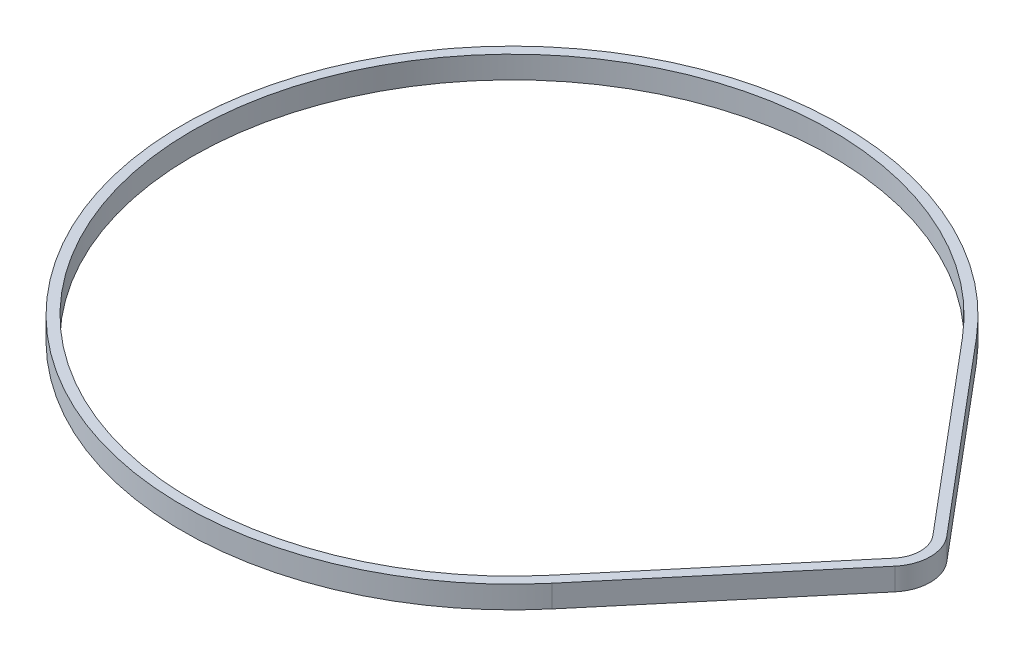
ISO-10303-21;
HEADER;
FILE_DESCRIPTION(('STEP AP214'),'2;1');
FILE_NAME('part.step','',(''),(''),'','','');
FILE_SCHEMA(('AUTOMOTIVE_DESIGN { 1 0 10303 214 1 1 1 1 }'));
ENDSEC;
DATA;
#1=APPLICATION_CONTEXT('core data for automotive mechanical design processes');
#2=APPLICATION_PROTOCOL_DEFINITION('international standard','automotive_design',2000,#1);
#3=PRODUCT_CONTEXT('',#1,'mechanical');
#4=PRODUCT('Part','Part','',(#3));
#5=PRODUCT_RELATED_PRODUCT_CATEGORY('part','',(#4));
#6=PRODUCT_DEFINITION_FORMATION('','',#4);
#7=PRODUCT_DEFINITION_CONTEXT('part definition',#1,'design');
#8=PRODUCT_DEFINITION('design','',#6,#7);
#9=PRODUCT_DEFINITION_SHAPE('','',#8);
#10=(LENGTH_UNIT() NAMED_UNIT(*) SI_UNIT(.MILLI.,.METRE.));
#11=(NAMED_UNIT(*) PLANE_ANGLE_UNIT() SI_UNIT($,.RADIAN.));
#12=(NAMED_UNIT(*) SI_UNIT($,.STERADIAN.) SOLID_ANGLE_UNIT());
#13=UNCERTAINTY_MEASURE_WITH_UNIT(LENGTH_MEASURE(1.E-05),#10,'distance_accuracy_value','');
#14=(GEOMETRIC_REPRESENTATION_CONTEXT(3) GLOBAL_UNCERTAINTY_ASSIGNED_CONTEXT((#13)) GLOBAL_UNIT_ASSIGNED_CONTEXT((#10,
#11,#12)) REPRESENTATION_CONTEXT('',''));
#15=CARTESIAN_POINT('',(0.,0.,0.));
#16=DIRECTION('',(0.,0.,1.));
#17=DIRECTION('',(1.,0.,0.));
#18=AXIS2_PLACEMENT_3D('',#15,#16,#17);
#19=CARTESIAN_POINT('',(52.578,3.0988,0.));
#20=DIRECTION('',(0.,1.,0.));
#21=DIRECTION('',(0.,0.,1.));
#22=AXIS2_PLACEMENT_3D('',#19,#20,#21);
#23=PLANE('',#22);
#24=CARTESIAN_POINT('',(52.578,3.0988,0.));
#25=DIRECTION('',(0.,1.,0.));
#26=DIRECTION('',(0.,0.,1.));
#27=AXIS2_PLACEMENT_3D('',#24,#25,#26);
#28=CIRCLE('',#27,5.588);
#29=CARTESIAN_POINT('',(56.8540347826087,3.0988,3.59739774530432));
#30=VERTEX_POINT('',#29);
#31=CARTESIAN_POINT('',(56.8540347826087,3.0988,-3.59739774530432));
#32=VERTEX_POINT('',#31);
#33=EDGE_CURVE('E469',#30,#32,#28,.T.);
#34=ORIENTED_EDGE('',*,*,#33,.T.);
#35=DIRECTION('',(-0.643771965874073,0.,-0.765217391304348));
#36=VECTOR('',#35,1.);
#37=CARTESIAN_POINT('',(35.0634852173913,3.0988,-29.4986615114954));
#38=LINE('',#37,#36);
#39=CARTESIAN_POINT('',(35.0634852173913,3.0988,-29.4986615114954));
#40=VERTEX_POINT('',#39);
#41=EDGE_CURVE('E472',#32,#40,#38,.T.);
#42=ORIENTED_EDGE('',*,*,#41,.T.);
#43=CARTESIAN_POINT('',(0.,3.0988,0.));
#44=DIRECTION('',(0.,1.,0.));
#45=DIRECTION('',(0.,0.,1.));
#46=AXIS2_PLACEMENT_3D('',#43,#44,#45);
#47=CIRCLE('',#46,45.8216);
#48=CARTESIAN_POINT('',(35.0634852173913,3.0988,29.4986615114954));
#49=VERTEX_POINT('',#48);
#50=EDGE_CURVE('E474',#40,#49,#47,.T.);
#51=ORIENTED_EDGE('',*,*,#50,.T.);
#52=DIRECTION('',(0.643771965874073,0.,-0.765217391304348));
#53=VECTOR('',#52,1.);
#54=CARTESIAN_POINT('',(56.8540347826087,3.0988,3.59739774530432));
#55=LINE('',#54,#53);
#56=EDGE_CURVE('E476',#49,#30,#55,.T.);
#57=ORIENTED_EDGE('',*,*,#56,.T.);
#58=EDGE_LOOP('',(#34,#42,#51,#57));
#59=FACE_BOUND('',#58,.T.);
#60=DIRECTION('',(0.643771965874073,0.,-0.765217391304348));
#61=VECTOR('',#60,1.);
#62=CARTESIAN_POINT('',(55.8044626086956,3.0988,2.71440011691144));
#63=LINE('',#62,#61);
#64=CARTESIAN_POINT('',(34.0139130434783,3.0988,28.6156638831025));
#65=VERTEX_POINT('',#64);
#66=CARTESIAN_POINT('',(55.8044626086956,3.0988,2.71440011691144));
#67=VERTEX_POINT('',#66);
#68=EDGE_CURVE('E451',#65,#67,#63,.T.);
#69=ORIENTED_EDGE('',*,*,#68,.F.);
#70=CARTESIAN_POINT('',(0.,3.0988,0.));
#71=DIRECTION('',(0.,1.,0.));
#72=DIRECTION('',(0.,0.,1.));
#73=AXIS2_PLACEMENT_3D('',#70,#71,#72);
#74=CIRCLE('',#73,44.45);
#75=CARTESIAN_POINT('',(34.0139130434782,3.0988,-28.6156638831025));
#76=VERTEX_POINT('',#75);
#77=EDGE_CURVE('E440',#76,#65,#74,.T.);
#78=ORIENTED_EDGE('',*,*,#77,.F.);
#79=DIRECTION('',(-0.643771965874073,0.,-0.765217391304348));
#80=VECTOR('',#79,1.);
#81=CARTESIAN_POINT('',(34.0139130434782,3.0988,-28.6156638831025));
#82=LINE('',#81,#80);
#83=CARTESIAN_POINT('',(55.8044626086957,3.0988,-2.71440011691144));
#84=VERTEX_POINT('',#83);
#85=EDGE_CURVE('E455',#84,#76,#82,.T.);
#86=ORIENTED_EDGE('',*,*,#85,.F.);
#87=CARTESIAN_POINT('',(52.578,3.0988,0.));
#88=DIRECTION('',(0.,1.,0.));
#89=DIRECTION('',(0.,0.,1.));
#90=AXIS2_PLACEMENT_3D('',#87,#88,#89);
#91=CIRCLE('',#90,4.2164);
#92=EDGE_CURVE('E453',#67,#84,#91,.T.);
#93=ORIENTED_EDGE('',*,*,#92,.F.);
#94=EDGE_LOOP('',(#69,#78,#86,#93));
#95=FACE_BOUND('',#94,.T.);
#96=ADVANCED_FACE('F360',(#59,#95),#23,.T.);
#97=CARTESIAN_POINT('',(52.578,0.,0.));
#98=DIRECTION('',(0.,1.,0.));
#99=DIRECTION('',(0.,0.,1.));
#100=AXIS2_PLACEMENT_3D('',#97,#98,#99);
#101=PLANE('',#100);
#102=CARTESIAN_POINT('',(52.578,0.,0.));
#103=DIRECTION('',(0.,1.,0.));
#104=DIRECTION('',(0.,0.,1.));
#105=AXIS2_PLACEMENT_3D('',#102,#103,#104);
#106=CIRCLE('',#105,5.588);
#107=CARTESIAN_POINT('',(56.8540347826087,0.,3.59739774530432));
#108=VERTEX_POINT('',#107);
#109=CARTESIAN_POINT('',(56.8540347826087,0.,-3.59739774530432));
#110=VERTEX_POINT('',#109);
#111=EDGE_CURVE('E441',#108,#110,#106,.T.);
#112=ORIENTED_EDGE('',*,*,#111,.F.);
#113=DIRECTION('',(0.643771965874073,0.,-0.765217391304348));
#114=VECTOR('',#113,1.);
#115=CARTESIAN_POINT('',(56.8540347826087,0.,3.59739774530432));
#116=LINE('',#115,#114);
#117=CARTESIAN_POINT('',(35.0634852173913,0.,29.4986615114954));
#118=VERTEX_POINT('',#117);
#119=EDGE_CURVE('E467',#118,#108,#116,.T.);
#120=ORIENTED_EDGE('',*,*,#119,.F.);
#121=CARTESIAN_POINT('',(0.,0.,0.));
#122=DIRECTION('',(0.,1.,0.));
#123=DIRECTION('',(0.,0.,1.));
#124=AXIS2_PLACEMENT_3D('',#121,#122,#123);
#125=CIRCLE('',#124,45.8216);
#126=CARTESIAN_POINT('',(35.0634852173913,0.,-29.4986615114954));
#127=VERTEX_POINT('',#126);
#128=EDGE_CURVE('E465',#127,#118,#125,.T.);
#129=ORIENTED_EDGE('',*,*,#128,.F.);
#130=DIRECTION('',(-0.643771965874073,0.,-0.765217391304348));
#131=VECTOR('',#130,1.);
#132=CARTESIAN_POINT('',(35.0634852173913,0.,-29.4986615114954));
#133=LINE('',#132,#131);
#134=EDGE_CURVE('E463',#110,#127,#133,.T.);
#135=ORIENTED_EDGE('',*,*,#134,.F.);
#136=EDGE_LOOP('',(#112,#120,#129,#135));
#137=FACE_BOUND('',#136,.T.);
#138=CARTESIAN_POINT('',(0.,0.,0.));
#139=DIRECTION('',(0.,1.,0.));
#140=DIRECTION('',(0.,0.,1.));
#141=AXIS2_PLACEMENT_3D('',#138,#139,#140);
#142=CIRCLE('',#141,44.45);
#143=CARTESIAN_POINT('',(34.0139130434782,0.,-28.6156638831025));
#144=VERTEX_POINT('',#143);
#145=CARTESIAN_POINT('',(34.0139130434783,0.,28.6156638831025));
#146=VERTEX_POINT('',#145);
#147=EDGE_CURVE('E383',#144,#146,#142,.T.);
#148=ORIENTED_EDGE('',*,*,#147,.T.);
#149=DIRECTION('',(0.643771965874073,0.,-0.765217391304348));
#150=VECTOR('',#149,1.);
#151=CARTESIAN_POINT('',(55.8044626086956,0.,2.71440011691144));
#152=LINE('',#151,#150);
#153=CARTESIAN_POINT('',(55.8044626086956,0.,2.71440011691144));
#154=VERTEX_POINT('',#153);
#155=EDGE_CURVE('E427',#146,#154,#152,.T.);
#156=ORIENTED_EDGE('',*,*,#155,.T.);
#157=CARTESIAN_POINT('',(52.578,0.,0.));
#158=DIRECTION('',(0.,1.,0.));
#159=DIRECTION('',(0.,0.,1.));
#160=AXIS2_PLACEMENT_3D('',#157,#158,#159);
#161=CIRCLE('',#160,4.2164);
#162=CARTESIAN_POINT('',(55.8044626086957,0.,-2.71440011691144));
#163=VERTEX_POINT('',#162);
#164=EDGE_CURVE('E436',#154,#163,#161,.T.);
#165=ORIENTED_EDGE('',*,*,#164,.T.);
#166=DIRECTION('',(-0.643771965874073,0.,-0.765217391304348));
#167=VECTOR('',#166,1.);
#168=CARTESIAN_POINT('',(34.0139130434782,0.,-28.6156638831025));
#169=LINE('',#168,#167);
#170=EDGE_CURVE('E445',#163,#144,#169,.T.);
#171=ORIENTED_EDGE('',*,*,#170,.T.);
#172=EDGE_LOOP('',(#148,#156,#165,#171));
#173=FACE_BOUND('',#172,.T.);
#174=ADVANCED_FACE('F444',(#137,#173),#101,.F.);
#175=CARTESIAN_POINT('',(52.578,3.0988,0.));
#176=DIRECTION('',(0.,-1.,0.));
#177=DIRECTION('',(0.,0.,-1.));
#178=AXIS2_PLACEMENT_3D('',#175,#176,#177);
#179=CYLINDRICAL_SURFACE('',#178,5.588);
#180=ORIENTED_EDGE('',*,*,#111,.T.);
#181=DIRECTION('',(0.,-1.,0.));
#182=VECTOR('',#181,1.);
#183=CARTESIAN_POINT('',(56.8540347826087,3.0988,-3.59739774530432));
#184=LINE('',#183,#182);
#185=EDGE_CURVE('E11',#32,#110,#184,.T.);
#186=ORIENTED_EDGE('',*,*,#185,.F.);
#187=ORIENTED_EDGE('',*,*,#33,.F.);
#188=DIRECTION('',(0.,-1.,0.));
#189=VECTOR('',#188,1.);
#190=CARTESIAN_POINT('',(56.8540347826087,3.0988,3.59739774530432));
#191=LINE('',#190,#189);
#192=EDGE_CURVE('E478',#30,#108,#191,.T.);
#193=ORIENTED_EDGE('',*,*,#192,.T.);
#194=EDGE_LOOP('',(#180,#186,#187,#193));
#195=FACE_BOUND('',#194,.T.);
#196=ADVANCED_FACE('F362',(#195),#179,.T.);
#197=CARTESIAN_POINT('',(35.0634852173913,3.0988,-29.4986615114954));
#198=DIRECTION('',(-0.765217391304348,0.,0.643771965874073));
#199=DIRECTION('',(0.643771965874073,0.,0.765217391304348));
#200=AXIS2_PLACEMENT_3D('',#197,#198,#199);
#201=PLANE('',#200);
#202=ORIENTED_EDGE('',*,*,#134,.T.);
#203=DIRECTION('',(0.,-1.,0.));
#204=VECTOR('',#203,1.);
#205=CARTESIAN_POINT('',(35.0634852173913,3.0988,-29.4986615114954));
#206=LINE('',#205,#204);
#207=EDGE_CURVE('E368',#40,#127,#206,.T.);
#208=ORIENTED_EDGE('',*,*,#207,.F.);
#209=ORIENTED_EDGE('',*,*,#41,.F.);
#210=ORIENTED_EDGE('',*,*,#185,.T.);
#211=EDGE_LOOP('',(#202,#208,#209,#210));
#212=FACE_BOUND('',#211,.T.);
#213=ADVANCED_FACE('F503',(#212),#201,.F.);
#214=CARTESIAN_POINT('',(0.,3.0988,0.));
#215=DIRECTION('',(0.,-1.,0.));
#216=DIRECTION('',(0.,0.,-1.));
#217=AXIS2_PLACEMENT_3D('',#214,#215,#216);
#218=CYLINDRICAL_SURFACE('',#217,45.8216);
#219=ORIENTED_EDGE('',*,*,#128,.T.);
#220=DIRECTION('',(0.,-1.,0.));
#221=VECTOR('',#220,1.);
#222=CARTESIAN_POINT('',(35.0634852173913,3.0988,29.4986615114954));
#223=LINE('',#222,#221);
#224=EDGE_CURVE('E481',#49,#118,#223,.T.);
#225=ORIENTED_EDGE('',*,*,#224,.F.);
#226=ORIENTED_EDGE('',*,*,#50,.F.);
#227=ORIENTED_EDGE('',*,*,#207,.T.);
#228=EDGE_LOOP('',(#219,#225,#226,#227));
#229=FACE_BOUND('',#228,.T.);
#230=ADVANCED_FACE('F488',(#229),#218,.T.);
#231=CARTESIAN_POINT('',(56.8540347826087,3.0988,3.59739774530432));
#232=DIRECTION('',(-0.765217391304348,0.,-0.643771965874073));
#233=DIRECTION('',(-0.643771965874073,0.,0.765217391304348));
#234=AXIS2_PLACEMENT_3D('',#231,#232,#233);
#235=PLANE('',#234);
#236=ORIENTED_EDGE('',*,*,#119,.T.);
#237=ORIENTED_EDGE('',*,*,#192,.F.);
#238=ORIENTED_EDGE('',*,*,#56,.F.);
#239=ORIENTED_EDGE('',*,*,#224,.T.);
#240=EDGE_LOOP('',(#236,#237,#238,#239));
#241=FACE_BOUND('',#240,.T.);
#242=ADVANCED_FACE('F496',(#241),#235,.F.);
#243=CARTESIAN_POINT('',(0.,3.0988,0.));
#244=DIRECTION('',(0.,-1.,0.));
#245=DIRECTION('',(0.,0.,-1.));
#246=AXIS2_PLACEMENT_3D('',#243,#244,#245);
#247=CYLINDRICAL_SURFACE('',#246,44.45);
#248=ORIENTED_EDGE('',*,*,#147,.F.);
#249=DIRECTION('',(0.,-1.,0.));
#250=VECTOR('',#249,1.);
#251=CARTESIAN_POINT('',(34.0139130434782,3.0988,-28.6156638831025));
#252=LINE('',#251,#250);
#253=EDGE_CURVE('E457',#76,#144,#252,.T.);
#254=ORIENTED_EDGE('',*,*,#253,.F.);
#255=ORIENTED_EDGE('',*,*,#77,.T.);
#256=DIRECTION('',(0.,-1.,0.));
#257=VECTOR('',#256,1.);
#258=CARTESIAN_POINT('',(34.0139130434783,3.0988,28.6156638831025));
#259=LINE('',#258,#257);
#260=EDGE_CURVE('E429',#65,#146,#259,.T.);
#261=ORIENTED_EDGE('',*,*,#260,.T.);
#262=EDGE_LOOP('',(#248,#254,#255,#261));
#263=FACE_BOUND('',#262,.T.);
#264=ADVANCED_FACE('F438',(#263),#247,.F.);
#265=CARTESIAN_POINT('',(55.8044626086956,3.0988,2.71440011691144));
#266=DIRECTION('',(-0.765217391304348,0.,-0.643771965874073));
#267=DIRECTION('',(-0.643771965874073,0.,0.765217391304348));
#268=AXIS2_PLACEMENT_3D('',#265,#266,#267);
#269=PLANE('',#268);
#270=ORIENTED_EDGE('',*,*,#155,.F.);
#271=ORIENTED_EDGE('',*,*,#260,.F.);
#272=ORIENTED_EDGE('',*,*,#68,.T.);
#273=DIRECTION('',(0.,-1.,0.));
#274=VECTOR('',#273,1.);
#275=CARTESIAN_POINT('',(55.8044626086956,3.0988,2.71440011691144));
#276=LINE('',#275,#274);
#277=EDGE_CURVE('E432',#67,#154,#276,.T.);
#278=ORIENTED_EDGE('',*,*,#277,.T.);
#279=EDGE_LOOP('',(#270,#271,#272,#278));
#280=FACE_BOUND('',#279,.T.);
#281=ADVANCED_FACE('F428',(#280),#269,.T.);
#282=CARTESIAN_POINT('',(52.578,3.0988,0.));
#283=DIRECTION('',(0.,-1.,0.));
#284=DIRECTION('',(0.,0.,-1.));
#285=AXIS2_PLACEMENT_3D('',#282,#283,#284);
#286=CYLINDRICAL_SURFACE('',#285,4.2164);
#287=ORIENTED_EDGE('',*,*,#164,.F.);
#288=ORIENTED_EDGE('',*,*,#277,.F.);
#289=ORIENTED_EDGE('',*,*,#92,.T.);
#290=DIRECTION('',(0.,-1.,0.));
#291=VECTOR('',#290,1.);
#292=CARTESIAN_POINT('',(55.8044626086957,3.0988,-2.71440011691144));
#293=LINE('',#292,#291);
#294=EDGE_CURVE('E375',#84,#163,#293,.T.);
#295=ORIENTED_EDGE('',*,*,#294,.T.);
#296=EDGE_LOOP('',(#287,#288,#289,#295));
#297=FACE_BOUND('',#296,.T.);
#298=ADVANCED_FACE('F525',(#297),#286,.F.);
#299=CARTESIAN_POINT('',(34.0139130434782,3.0988,-28.6156638831025));
#300=DIRECTION('',(-0.765217391304348,0.,0.643771965874073));
#301=DIRECTION('',(0.643771965874073,0.,0.765217391304348));
#302=AXIS2_PLACEMENT_3D('',#299,#300,#301);
#303=PLANE('',#302);
#304=ORIENTED_EDGE('',*,*,#170,.F.);
#305=ORIENTED_EDGE('',*,*,#294,.F.);
#306=ORIENTED_EDGE('',*,*,#85,.T.);
#307=ORIENTED_EDGE('',*,*,#253,.T.);
#308=EDGE_LOOP('',(#304,#305,#306,#307));
#309=FACE_BOUND('',#308,.T.);
#310=ADVANCED_FACE('F530',(#309),#303,.T.);
#311=CLOSED_SHELL('',(#96,#174,#196,#213,#230,#242,#264,#281,#298,#310));
#312=MANIFOLD_SOLID_BREP('B2',#311);
#313=ADVANCED_BREP_SHAPE_REPRESENTATION('',(#18,#312),#14);
#314=SHAPE_DEFINITION_REPRESENTATION(#9,#313);
ENDSEC;
END-ISO-10303-21;
